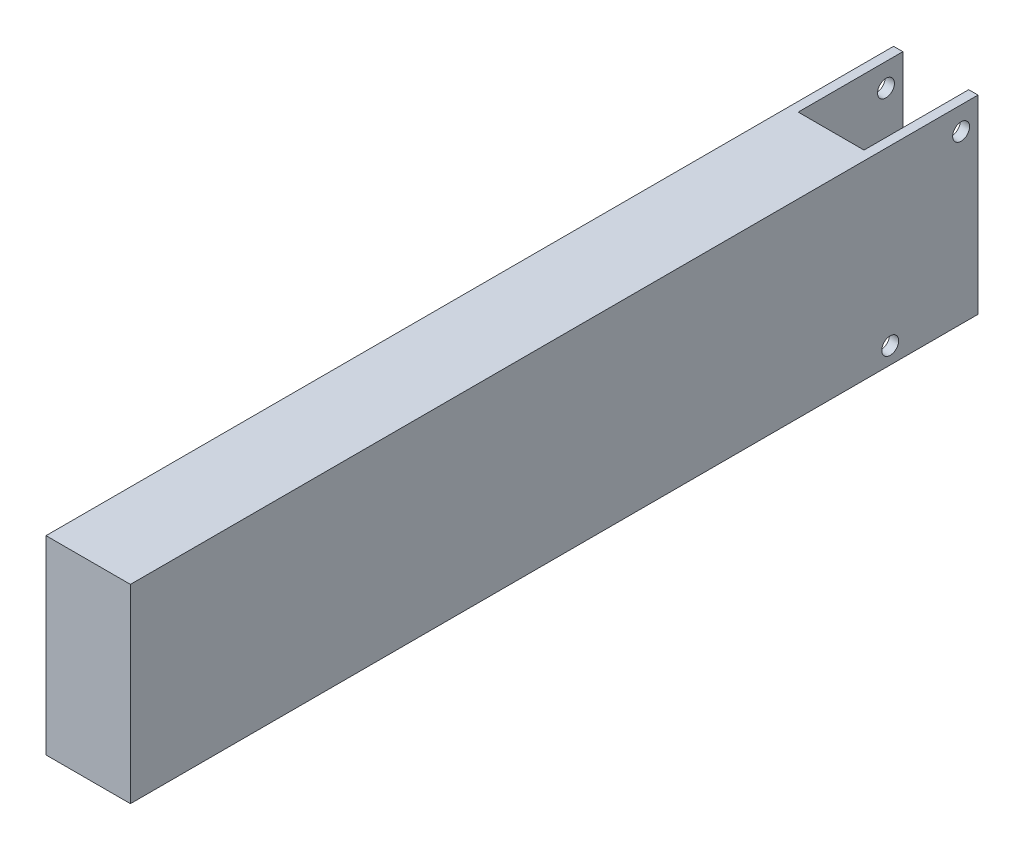
ISO-10303-21;
HEADER;
FILE_DESCRIPTION(('STEP AP214'),'2;1');
FILE_NAME('part.step','',(''),(''),'','','');
FILE_SCHEMA(('AUTOMOTIVE_DESIGN { 1 0 10303 214 1 1 1 1 }'));
ENDSEC;
DATA;
#1=APPLICATION_CONTEXT('core data for automotive mechanical design processes');
#2=APPLICATION_PROTOCOL_DEFINITION('international standard','automotive_design',2000,#1);
#3=PRODUCT_CONTEXT('',#1,'mechanical');
#4=PRODUCT('Part','Part','',(#3));
#5=PRODUCT_RELATED_PRODUCT_CATEGORY('part','',(#4));
#6=PRODUCT_DEFINITION_FORMATION('','',#4);
#7=PRODUCT_DEFINITION_CONTEXT('part definition',#1,'design');
#8=PRODUCT_DEFINITION('design','',#6,#7);
#9=PRODUCT_DEFINITION_SHAPE('','',#8);
#10=(LENGTH_UNIT() NAMED_UNIT(*) SI_UNIT(.MILLI.,.METRE.));
#11=(NAMED_UNIT(*) PLANE_ANGLE_UNIT() SI_UNIT($,.RADIAN.));
#12=(NAMED_UNIT(*) SI_UNIT($,.STERADIAN.) SOLID_ANGLE_UNIT());
#13=UNCERTAINTY_MEASURE_WITH_UNIT(LENGTH_MEASURE(1.E-05),#10,'distance_accuracy_value','');
#14=(GEOMETRIC_REPRESENTATION_CONTEXT(3) GLOBAL_UNCERTAINTY_ASSIGNED_CONTEXT((#13)) GLOBAL_UNIT_ASSIGNED_CONTEXT((#10,
#11,#12)) REPRESENTATION_CONTEXT('',''));
#15=CARTESIAN_POINT('',(0.,0.,0.));
#16=DIRECTION('',(0.,0.,1.));
#17=DIRECTION('',(1.,0.,0.));
#18=AXIS2_PLACEMENT_3D('',#15,#16,#17);
#19=CARTESIAN_POINT('',(0.,0.,0.));
#20=DIRECTION('',(0.,0.,-1.));
#21=DIRECTION('',(-1.,0.,0.));
#22=AXIS2_PLACEMENT_3D('',#19,#20,#21);
#23=PLANE('',#22);
#24=DIRECTION('',(-1.,0.,0.));
#25=VECTOR('',#24,1.);
#26=CARTESIAN_POINT('',(0.,28.575,0.));
#27=LINE('',#26,#25);
#28=CARTESIAN_POINT('',(11.303,28.575,0.));
#29=VERTEX_POINT('',#28);
#30=CARTESIAN_POINT('',(1.397,28.575,0.));
#31=VERTEX_POINT('',#30);
#32=EDGE_CURVE('E66',#29,#31,#27,.T.);
#33=ORIENTED_EDGE('',*,*,#32,.F.);
#34=DIRECTION('',(0.,1.,0.));
#35=VECTOR('',#34,1.);
#36=CARTESIAN_POINT('',(11.303,28.575,0.));
#37=LINE('',#36,#35);
#38=CARTESIAN_POINT('',(11.303,0.,0.));
#39=VERTEX_POINT('',#38);
#40=EDGE_CURVE('E114',#39,#29,#37,.T.);
#41=ORIENTED_EDGE('',*,*,#40,.F.);
#42=DIRECTION('',(1.,0.,0.));
#43=VECTOR('',#42,1.);
#44=CARTESIAN_POINT('',(0.,0.,0.));
#45=LINE('',#44,#43);
#46=CARTESIAN_POINT('',(1.397,0.,0.));
#47=VERTEX_POINT('',#46);
#48=EDGE_CURVE('E123',#47,#39,#45,.T.);
#49=ORIENTED_EDGE('',*,*,#48,.F.);
#50=DIRECTION('',(0.,-1.,0.));
#51=VECTOR('',#50,1.);
#52=CARTESIAN_POINT('',(1.397,28.575,0.));
#53=LINE('',#52,#51);
#54=EDGE_CURVE('E126',#31,#47,#53,.T.);
#55=ORIENTED_EDGE('',*,*,#54,.F.);
#56=EDGE_LOOP('',(#33,#41,#49,#55));
#57=FACE_BOUND('',#56,.T.);
#58=ADVANCED_FACE('F43',(#57),#23,.T.);
#59=CARTESIAN_POINT('',(0.,0.,111.76));
#60=DIRECTION('',(1.,0.,0.));
#61=DIRECTION('',(0.,0.,-1.));
#62=AXIS2_PLACEMENT_3D('',#59,#60,#61);
#63=PLANE('',#62);
#64=CARTESIAN_POINT('',(0.,25.0952,-13.208));
#65=DIRECTION('',(-1.,0.,0.));
#66=DIRECTION('',(0.,0.,1.));
#67=AXIS2_PLACEMENT_3D('',#64,#65,#66);
#68=CIRCLE('',#67,1.27000000000001);
#69=CARTESIAN_POINT('',(0.,25.0952,-11.938));
#70=VERTEX_POINT('',#69);
#71=EDGE_CURVE('E164',#70,#70,#68,.T.);
#72=ORIENTED_EDGE('',*,*,#71,.F.);
#73=EDGE_LOOP('',(#72));
#74=FACE_BOUND('',#73,.T.);
#75=CARTESIAN_POINT('',(0.,2.53999999999995,-2.53999999999999));
#76=DIRECTION('',(-1.,0.,0.));
#77=DIRECTION('',(0.,0.,1.));
#78=AXIS2_PLACEMENT_3D('',#75,#76,#77);
#79=CIRCLE('',#78,1.27000000000002);
#80=CARTESIAN_POINT('',(0.,2.53999999999995,-1.26999999999997));
#81=VERTEX_POINT('',#80);
#82=EDGE_CURVE('E170',#81,#81,#79,.T.);
#83=ORIENTED_EDGE('',*,*,#82,.F.);
#84=EDGE_LOOP('',(#83));
#85=FACE_BOUND('',#84,.T.);
#86=DIRECTION('',(0.,0.,-1.));
#87=VECTOR('',#86,1.);
#88=CARTESIAN_POINT('',(0.,28.575,111.76));
#89=LINE('',#88,#87);
#90=CARTESIAN_POINT('',(0.,28.575,111.76));
#91=VERTEX_POINT('',#90);
#92=CARTESIAN_POINT('',(0.,28.575,-15.748));
#93=VERTEX_POINT('',#92);
#94=EDGE_CURVE('E145',#91,#93,#89,.T.);
#95=ORIENTED_EDGE('',*,*,#94,.T.);
#96=DIRECTION('',(0.,1.,0.));
#97=VECTOR('',#96,1.);
#98=CARTESIAN_POINT('',(0.,28.575,-15.748));
#99=LINE('',#98,#97);
#100=CARTESIAN_POINT('',(0.,0.,-15.748));
#101=VERTEX_POINT('',#100);
#102=EDGE_CURVE('E205',#101,#93,#99,.T.);
#103=ORIENTED_EDGE('',*,*,#102,.F.);
#104=DIRECTION('',(0.,0.,-1.));
#105=VECTOR('',#104,1.);
#106=CARTESIAN_POINT('',(0.,0.,111.76));
#107=LINE('',#106,#105);
#108=CARTESIAN_POINT('',(0.,0.,111.76));
#109=VERTEX_POINT('',#108);
#110=EDGE_CURVE('E11',#109,#101,#107,.T.);
#111=ORIENTED_EDGE('',*,*,#110,.F.);
#112=DIRECTION('',(0.,-1.,0.));
#113=VECTOR('',#112,1.);
#114=CARTESIAN_POINT('',(0.,0.,111.76));
#115=LINE('',#114,#113);
#116=EDGE_CURVE('E137',#91,#109,#115,.T.);
#117=ORIENTED_EDGE('',*,*,#116,.F.);
#118=EDGE_LOOP('',(#95,#103,#111,#117));
#119=FACE_BOUND('',#118,.T.);
#120=ADVANCED_FACE('F45',(#74,#85,#119),#63,.F.);
#121=CARTESIAN_POINT('',(0.,0.,111.76));
#122=DIRECTION('',(0.,1.,0.));
#123=DIRECTION('',(0.,0.,1.));
#124=AXIS2_PLACEMENT_3D('',#121,#122,#123);
#125=PLANE('',#124);
#126=ORIENTED_EDGE('',*,*,#110,.T.);
#127=DIRECTION('',(-1.,0.,0.));
#128=VECTOR('',#127,1.);
#129=CARTESIAN_POINT('',(1.397,0.,-15.748));
#130=LINE('',#129,#128);
#131=CARTESIAN_POINT('',(1.397,0.,-15.748));
#132=VERTEX_POINT('',#131);
#133=EDGE_CURVE('E201',#132,#101,#130,.T.);
#134=ORIENTED_EDGE('',*,*,#133,.F.);
#135=DIRECTION('',(0.,0.,1.));
#136=VECTOR('',#135,1.);
#137=CARTESIAN_POINT('',(1.397,0.,-15.748));
#138=LINE('',#137,#136);
#139=EDGE_CURVE('E131',#132,#47,#138,.T.);
#140=ORIENTED_EDGE('',*,*,#139,.T.);
#141=ORIENTED_EDGE('',*,*,#48,.T.);
#142=DIRECTION('',(0.,0.,1.));
#143=VECTOR('',#142,1.);
#144=CARTESIAN_POINT('',(11.303,0.,-15.748));
#145=LINE('',#144,#143);
#146=CARTESIAN_POINT('',(11.303,0.,-15.748));
#147=VERTEX_POINT('',#146);
#148=EDGE_CURVE('E111',#147,#39,#145,.T.);
#149=ORIENTED_EDGE('',*,*,#148,.F.);
#150=DIRECTION('',(-1.,0.,0.));
#151=VECTOR('',#150,1.);
#152=CARTESIAN_POINT('',(12.7,0.,-15.748));
#153=LINE('',#152,#151);
#154=CARTESIAN_POINT('',(12.7,0.,-15.748));
#155=VERTEX_POINT('',#154);
#156=EDGE_CURVE('E191',#155,#147,#153,.T.);
#157=ORIENTED_EDGE('',*,*,#156,.F.);
#158=DIRECTION('',(0.,0.,-1.));
#159=VECTOR('',#158,1.);
#160=CARTESIAN_POINT('',(12.7,0.,111.76));
#161=LINE('',#160,#159);
#162=CARTESIAN_POINT('',(12.7,0.,111.76));
#163=VERTEX_POINT('',#162);
#164=EDGE_CURVE('E53',#163,#155,#161,.T.);
#165=ORIENTED_EDGE('',*,*,#164,.F.);
#166=DIRECTION('',(1.,0.,0.));
#167=VECTOR('',#166,1.);
#168=CARTESIAN_POINT('',(0.,0.,111.76));
#169=LINE('',#168,#167);
#170=EDGE_CURVE('E220',#109,#163,#169,.T.);
#171=ORIENTED_EDGE('',*,*,#170,.F.);
#172=EDGE_LOOP('',(#126,#134,#140,#141,#149,#157,#165,#171));
#173=FACE_BOUND('',#172,.T.);
#174=ADVANCED_FACE('F129',(#173),#125,.F.);
#175=CARTESIAN_POINT('',(12.7,0.,111.76));
#176=DIRECTION('',(-1.,0.,0.));
#177=DIRECTION('',(0.,0.,1.));
#178=AXIS2_PLACEMENT_3D('',#175,#176,#177);
#179=PLANE('',#178);
#180=CARTESIAN_POINT('',(12.7,25.0952,-13.208));
#181=DIRECTION('',(-1.,0.,0.));
#182=DIRECTION('',(0.,0.,1.));
#183=AXIS2_PLACEMENT_3D('',#180,#181,#182);
#184=CIRCLE('',#183,1.27000000000001);
#185=CARTESIAN_POINT('',(12.7,25.0952,-11.938));
#186=VERTEX_POINT('',#185);
#187=EDGE_CURVE('E156',#186,#186,#184,.T.);
#188=ORIENTED_EDGE('',*,*,#187,.T.);
#189=EDGE_LOOP('',(#188));
#190=FACE_BOUND('',#189,.T.);
#191=CARTESIAN_POINT('',(12.7,2.53999999999995,-2.53999999999999));
#192=DIRECTION('',(-1.,0.,0.));
#193=DIRECTION('',(0.,0.,1.));
#194=AXIS2_PLACEMENT_3D('',#191,#192,#193);
#195=CIRCLE('',#194,1.27000000000002);
#196=CARTESIAN_POINT('',(12.7,2.53999999999995,-1.26999999999997));
#197=VERTEX_POINT('',#196);
#198=EDGE_CURVE('E176',#197,#197,#195,.T.);
#199=ORIENTED_EDGE('',*,*,#198,.T.);
#200=EDGE_LOOP('',(#199));
#201=FACE_BOUND('',#200,.T.);
#202=ORIENTED_EDGE('',*,*,#164,.T.);
#203=DIRECTION('',(0.,-1.,0.));
#204=VECTOR('',#203,1.);
#205=CARTESIAN_POINT('',(12.7,28.575,-15.748));
#206=LINE('',#205,#204);
#207=CARTESIAN_POINT('',(12.7,28.575,-15.748));
#208=VERTEX_POINT('',#207);
#209=EDGE_CURVE('E127',#208,#155,#206,.T.);
#210=ORIENTED_EDGE('',*,*,#209,.F.);
#211=DIRECTION('',(0.,0.,-1.));
#212=VECTOR('',#211,1.);
#213=CARTESIAN_POINT('',(12.7,28.575,111.76));
#214=LINE('',#213,#212);
#215=CARTESIAN_POINT('',(12.7,28.575,111.76));
#216=VERTEX_POINT('',#215);
#217=EDGE_CURVE('E148',#216,#208,#214,.T.);
#218=ORIENTED_EDGE('',*,*,#217,.F.);
#219=DIRECTION('',(0.,1.,0.));
#220=VECTOR('',#219,1.);
#221=CARTESIAN_POINT('',(12.7,0.,111.76));
#222=LINE('',#221,#220);
#223=EDGE_CURVE('E222',#163,#216,#222,.T.);
#224=ORIENTED_EDGE('',*,*,#223,.F.);
#225=EDGE_LOOP('',(#202,#210,#218,#224));
#226=FACE_BOUND('',#225,.T.);
#227=ADVANCED_FACE('F262',(#190,#201,#226),#179,.F.);
#228=CARTESIAN_POINT('',(0.,28.575,111.76));
#229=DIRECTION('',(0.,-1.,0.));
#230=DIRECTION('',(0.,0.,-1.));
#231=AXIS2_PLACEMENT_3D('',#228,#229,#230);
#232=PLANE('',#231);
#233=ORIENTED_EDGE('',*,*,#217,.T.);
#234=DIRECTION('',(1.,0.,0.));
#235=VECTOR('',#234,1.);
#236=CARTESIAN_POINT('',(12.7,28.575,-15.748));
#237=LINE('',#236,#235);
#238=CARTESIAN_POINT('',(11.303,28.575,-15.748));
#239=VERTEX_POINT('',#238);
#240=EDGE_CURVE('E184',#239,#208,#237,.T.);
#241=ORIENTED_EDGE('',*,*,#240,.F.);
#242=DIRECTION('',(0.,0.,1.));
#243=VECTOR('',#242,1.);
#244=CARTESIAN_POINT('',(11.303,28.575,-15.748));
#245=LINE('',#244,#243);
#246=EDGE_CURVE('E61',#239,#29,#245,.T.);
#247=ORIENTED_EDGE('',*,*,#246,.T.);
#248=ORIENTED_EDGE('',*,*,#32,.T.);
#249=DIRECTION('',(0.,0.,1.));
#250=VECTOR('',#249,1.);
#251=CARTESIAN_POINT('',(1.397,28.575,-15.748));
#252=LINE('',#251,#250);
#253=CARTESIAN_POINT('',(1.397,28.575,-15.748));
#254=VERTEX_POINT('',#253);
#255=EDGE_CURVE('E139',#254,#31,#252,.T.);
#256=ORIENTED_EDGE('',*,*,#255,.F.);
#257=DIRECTION('',(1.,0.,0.));
#258=VECTOR('',#257,1.);
#259=CARTESIAN_POINT('',(1.397,28.575,-15.748));
#260=LINE('',#259,#258);
#261=EDGE_CURVE('E209',#93,#254,#260,.T.);
#262=ORIENTED_EDGE('',*,*,#261,.F.);
#263=ORIENTED_EDGE('',*,*,#94,.F.);
#264=DIRECTION('',(-1.,0.,0.));
#265=VECTOR('',#264,1.);
#266=CARTESIAN_POINT('',(0.,28.575,111.76));
#267=LINE('',#266,#265);
#268=EDGE_CURVE('E142',#216,#91,#267,.T.);
#269=ORIENTED_EDGE('',*,*,#268,.F.);
#270=EDGE_LOOP('',(#233,#241,#247,#248,#256,#262,#263,#269));
#271=FACE_BOUND('',#270,.T.);
#272=ADVANCED_FACE('F234',(#271),#232,.F.);
#273=CARTESIAN_POINT('',(0.,0.,111.76));
#274=DIRECTION('',(0.,0.,-1.));
#275=DIRECTION('',(-1.,0.,0.));
#276=AXIS2_PLACEMENT_3D('',#273,#274,#275);
#277=PLANE('',#276);
#278=ORIENTED_EDGE('',*,*,#116,.T.);
#279=ORIENTED_EDGE('',*,*,#170,.T.);
#280=ORIENTED_EDGE('',*,*,#223,.T.);
#281=ORIENTED_EDGE('',*,*,#268,.T.);
#282=EDGE_LOOP('',(#278,#279,#280,#281));
#283=FACE_BOUND('',#282,.T.);
#284=ADVANCED_FACE('F230',(#283),#277,.F.);
#285=CARTESIAN_POINT('',(1.397,28.575,-15.748));
#286=DIRECTION('',(-1.,0.,0.));
#287=DIRECTION('',(0.,0.,1.));
#288=AXIS2_PLACEMENT_3D('',#285,#286,#287);
#289=PLANE('',#288);
#290=CARTESIAN_POINT('',(1.397,25.0952,-13.208));
#291=DIRECTION('',(-1.,0.,0.));
#292=DIRECTION('',(0.,0.,1.));
#293=AXIS2_PLACEMENT_3D('',#290,#291,#292);
#294=CIRCLE('',#293,1.27000000000001);
#295=CARTESIAN_POINT('',(1.397,25.0952,-11.938));
#296=VERTEX_POINT('',#295);
#297=EDGE_CURVE('E120',#296,#296,#294,.T.);
#298=ORIENTED_EDGE('',*,*,#297,.T.);
#299=EDGE_LOOP('',(#298));
#300=FACE_BOUND('',#299,.T.);
#301=CARTESIAN_POINT('',(1.397,2.53999999999995,-2.53999999999999));
#302=DIRECTION('',(-1.,0.,0.));
#303=DIRECTION('',(0.,0.,1.));
#304=AXIS2_PLACEMENT_3D('',#301,#302,#303);
#305=CIRCLE('',#304,1.27000000000002);
#306=CARTESIAN_POINT('',(1.397,2.53999999999995,-1.26999999999997));
#307=VERTEX_POINT('',#306);
#308=EDGE_CURVE('E155',#307,#307,#305,.T.);
#309=ORIENTED_EDGE('',*,*,#308,.T.);
#310=EDGE_LOOP('',(#309));
#311=FACE_BOUND('',#310,.T.);
#312=ORIENTED_EDGE('',*,*,#54,.T.);
#313=ORIENTED_EDGE('',*,*,#139,.F.);
#314=DIRECTION('',(0.,-1.,0.));
#315=VECTOR('',#314,1.);
#316=CARTESIAN_POINT('',(1.397,28.575,-15.748));
#317=LINE('',#316,#315);
#318=EDGE_CURVE('E197',#254,#132,#317,.T.);
#319=ORIENTED_EDGE('',*,*,#318,.F.);
#320=ORIENTED_EDGE('',*,*,#255,.T.);
#321=EDGE_LOOP('',(#312,#313,#319,#320));
#322=FACE_BOUND('',#321,.T.);
#323=ADVANCED_FACE('F242',(#300,#311,#322),#289,.F.);
#324=CARTESIAN_POINT('',(0.,0.,-15.748));
#325=DIRECTION('',(0.,0.,-1.));
#326=DIRECTION('',(-1.,0.,0.));
#327=AXIS2_PLACEMENT_3D('',#324,#325,#326);
#328=PLANE('',#327);
#329=ORIENTED_EDGE('',*,*,#318,.T.);
#330=ORIENTED_EDGE('',*,*,#133,.T.);
#331=ORIENTED_EDGE('',*,*,#102,.T.);
#332=ORIENTED_EDGE('',*,*,#261,.T.);
#333=EDGE_LOOP('',(#329,#330,#331,#332));
#334=FACE_BOUND('',#333,.T.);
#335=ADVANCED_FACE('F239',(#334),#328,.T.);
#336=CARTESIAN_POINT('',(11.303,28.575,-15.748));
#337=DIRECTION('',(1.,0.,0.));
#338=DIRECTION('',(0.,0.,-1.));
#339=AXIS2_PLACEMENT_3D('',#336,#337,#338);
#340=PLANE('',#339);
#341=CARTESIAN_POINT('',(11.303,25.0952,-13.208));
#342=DIRECTION('',(1.,0.,0.));
#343=DIRECTION('',(0.,0.,-1.));
#344=AXIS2_PLACEMENT_3D('',#341,#342,#343);
#345=CIRCLE('',#344,1.27000000000001);
#346=CARTESIAN_POINT('',(11.303,25.0952,-14.478));
#347=VERTEX_POINT('',#346);
#348=EDGE_CURVE('E47',#347,#347,#345,.T.);
#349=ORIENTED_EDGE('',*,*,#348,.T.);
#350=EDGE_LOOP('',(#349));
#351=FACE_BOUND('',#350,.T.);
#352=CARTESIAN_POINT('',(11.303,2.53999999999995,-2.53999999999999));
#353=DIRECTION('',(1.,0.,0.));
#354=DIRECTION('',(0.,0.,-1.));
#355=AXIS2_PLACEMENT_3D('',#352,#353,#354);
#356=CIRCLE('',#355,1.27000000000002);
#357=CARTESIAN_POINT('',(11.303,2.53999999999995,-3.81000000000001));
#358=VERTEX_POINT('',#357);
#359=EDGE_CURVE('E152',#358,#358,#356,.T.);
#360=ORIENTED_EDGE('',*,*,#359,.T.);
#361=EDGE_LOOP('',(#360));
#362=FACE_BOUND('',#361,.T.);
#363=ORIENTED_EDGE('',*,*,#40,.T.);
#364=ORIENTED_EDGE('',*,*,#246,.F.);
#365=DIRECTION('',(0.,1.,0.));
#366=VECTOR('',#365,1.);
#367=CARTESIAN_POINT('',(11.303,28.575,-15.748));
#368=LINE('',#367,#366);
#369=EDGE_CURVE('E115',#147,#239,#368,.T.);
#370=ORIENTED_EDGE('',*,*,#369,.F.);
#371=ORIENTED_EDGE('',*,*,#148,.T.);
#372=EDGE_LOOP('',(#363,#364,#370,#371));
#373=FACE_BOUND('',#372,.T.);
#374=ADVANCED_FACE('F113',(#351,#362,#373),#340,.F.);
#375=CARTESIAN_POINT('',(0.,0.,-15.748));
#376=DIRECTION('',(0.,0.,-1.));
#377=DIRECTION('',(-1.,0.,0.));
#378=AXIS2_PLACEMENT_3D('',#375,#376,#377);
#379=PLANE('',#378);
#380=ORIENTED_EDGE('',*,*,#209,.T.);
#381=ORIENTED_EDGE('',*,*,#156,.T.);
#382=ORIENTED_EDGE('',*,*,#369,.T.);
#383=ORIENTED_EDGE('',*,*,#240,.T.);
#384=EDGE_LOOP('',(#380,#381,#382,#383));
#385=FACE_BOUND('',#384,.T.);
#386=ADVANCED_FACE('F312',(#385),#379,.T.);
#387=CARTESIAN_POINT('',(12.7,2.53999999999995,-2.53999999999999));
#388=DIRECTION('',(-1.,0.,0.));
#389=DIRECTION('',(0.,0.,1.));
#390=AXIS2_PLACEMENT_3D('',#387,#388,#389);
#391=CYLINDRICAL_SURFACE('',#390,1.27000000000002);
#392=ORIENTED_EDGE('',*,*,#198,.F.);
#393=EDGE_LOOP('',(#392));
#394=FACE_BOUND('',#393,.T.);
#395=ORIENTED_EDGE('',*,*,#359,.F.);
#396=EDGE_LOOP('',(#395));
#397=FACE_BOUND('',#396,.T.);
#398=ADVANCED_FACE('F322',(#394,#397),#391,.F.);
#399=CARTESIAN_POINT('',(12.7,25.0952,-13.208));
#400=DIRECTION('',(-1.,0.,0.));
#401=DIRECTION('',(0.,0.,1.));
#402=AXIS2_PLACEMENT_3D('',#399,#400,#401);
#403=CYLINDRICAL_SURFACE('',#402,1.27000000000001);
#404=ORIENTED_EDGE('',*,*,#187,.F.);
#405=EDGE_LOOP('',(#404));
#406=FACE_BOUND('',#405,.T.);
#407=ORIENTED_EDGE('',*,*,#348,.F.);
#408=EDGE_LOOP('',(#407));
#409=FACE_BOUND('',#408,.T.);
#410=ADVANCED_FACE('F332',(#406,#409),#403,.F.);
#411=ORIENTED_EDGE('',*,*,#82,.T.);
#412=EDGE_LOOP('',(#411));
#413=FACE_BOUND('',#412,.T.);
#414=ORIENTED_EDGE('',*,*,#308,.F.);
#415=EDGE_LOOP('',(#414));
#416=FACE_BOUND('',#415,.T.);
#417=ADVANCED_FACE('F335',(#413,#416),#391,.F.);
#418=ORIENTED_EDGE('',*,*,#71,.T.);
#419=EDGE_LOOP('',(#418));
#420=FACE_BOUND('',#419,.T.);
#421=ORIENTED_EDGE('',*,*,#297,.F.);
#422=EDGE_LOOP('',(#421));
#423=FACE_BOUND('',#422,.T.);
#424=ADVANCED_FACE('F345',(#420,#423),#403,.F.);
#425=CLOSED_SHELL('',(#58,#120,#174,#227,#272,#284,#323,#335,#374,#386,#398,#410,#417,#424));
#426=MANIFOLD_SOLID_BREP('B2',#425);
#427=ADVANCED_BREP_SHAPE_REPRESENTATION('',(#18,#426),#14);
#428=SHAPE_DEFINITION_REPRESENTATION(#9,#427);
ENDSEC;
END-ISO-10303-21;
